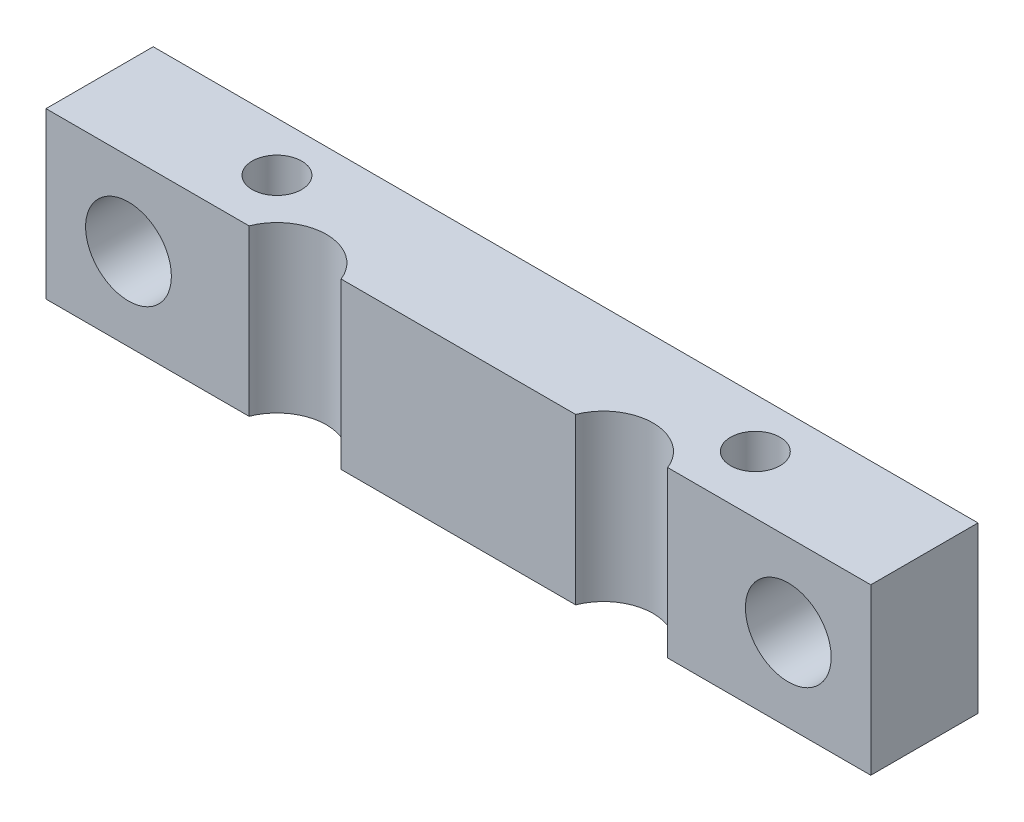
ISO-10303-21;
HEADER;
FILE_DESCRIPTION(('STEP AP214'),'2;1');
FILE_NAME('part.step','',(''),(''),'','','');
FILE_SCHEMA(('AUTOMOTIVE_DESIGN { 1 0 10303 214 1 1 1 1 }'));
ENDSEC;
DATA;
#1=APPLICATION_CONTEXT('core data for automotive mechanical design processes');
#2=APPLICATION_PROTOCOL_DEFINITION('international standard','automotive_design',2000,#1);
#3=PRODUCT_CONTEXT('',#1,'mechanical');
#4=PRODUCT('Part','Part','',(#3));
#5=PRODUCT_RELATED_PRODUCT_CATEGORY('part','',(#4));
#6=PRODUCT_DEFINITION_FORMATION('','',#4);
#7=PRODUCT_DEFINITION_CONTEXT('part definition',#1,'design');
#8=PRODUCT_DEFINITION('design','',#6,#7);
#9=PRODUCT_DEFINITION_SHAPE('','',#8);
#10=(LENGTH_UNIT() NAMED_UNIT(*) SI_UNIT(.MILLI.,.METRE.));
#11=(NAMED_UNIT(*) PLANE_ANGLE_UNIT() SI_UNIT($,.RADIAN.));
#12=(NAMED_UNIT(*) SI_UNIT($,.STERADIAN.) SOLID_ANGLE_UNIT());
#13=UNCERTAINTY_MEASURE_WITH_UNIT(LENGTH_MEASURE(1.E-05),#10,'distance_accuracy_value','');
#14=(GEOMETRIC_REPRESENTATION_CONTEXT(3) GLOBAL_UNCERTAINTY_ASSIGNED_CONTEXT((#13)) GLOBAL_UNIT_ASSIGNED_CONTEXT((#10,
#11,#12)) REPRESENTATION_CONTEXT('',''));
#15=CARTESIAN_POINT('',(0.,0.,0.));
#16=DIRECTION('',(0.,0.,1.));
#17=DIRECTION('',(1.,0.,0.));
#18=AXIS2_PLACEMENT_3D('',#15,#16,#17);
#19=CARTESIAN_POINT('',(15.1005050633883,10.,1.10050506338833));
#20=DIRECTION('',(0.,1.,0.));
#21=DIRECTION('',(0.,0.,1.));
#22=AXIS2_PLACEMENT_3D('',#19,#20,#21);
#23=PLANE('',#22);
#24=CARTESIAN_POINT('',(10.5,10.,-3.5));
#25=DIRECTION('',(0.,1.,0.));
#26=DIRECTION('',(0.,0.,1.));
#27=AXIS2_PLACEMENT_3D('',#24,#25,#26);
#28=CIRCLE('',#27,1.5);
#29=CARTESIAN_POINT('',(10.5,10.,-2.));
#30=VERTEX_POINT('',#29);
#31=EDGE_CURVE('E135',#30,#30,#28,.T.);
#32=ORIENTED_EDGE('',*,*,#31,.F.);
#33=EDGE_LOOP('',(#32));
#34=FACE_BOUND('',#33,.T.);
#35=DIRECTION('',(0.,0.,1.));
#36=VECTOR('',#35,1.);
#37=CARTESIAN_POINT('',(0.,10.,-6.5));
#38=LINE('',#37,#36);
#39=CARTESIAN_POINT('',(0.,10.,-6.5));
#40=VERTEX_POINT('',#39);
#41=CARTESIAN_POINT('',(0.,10.,0.));
#42=VERTEX_POINT('',#41);
#43=EDGE_CURVE('E146',#40,#42,#38,.T.);
#44=ORIENTED_EDGE('',*,*,#43,.T.);
#45=DIRECTION('',(1.,0.,0.));
#46=VECTOR('',#45,1.);
#47=CARTESIAN_POINT('',(0.,10.,0.));
#48=LINE('',#47,#46);
#49=CARTESIAN_POINT('',(12.3096470223091,10.,0.));
#50=VERTEX_POINT('',#49);
#51=EDGE_CURVE('E94',#42,#50,#48,.T.);
#52=ORIENTED_EDGE('',*,*,#51,.T.);
#53=CARTESIAN_POINT('',(15.1005050633883,10.,1.10050506338833));
#54=DIRECTION('',(0.,-1.,0.));
#55=DIRECTION('',(0.,0.,1.));
#56=AXIS2_PLACEMENT_3D('',#53,#54,#55);
#57=CIRCLE('',#56,3.);
#58=CARTESIAN_POINT('',(17.8913631044676,10.,0.));
#59=VERTEX_POINT('',#58);
#60=EDGE_CURVE('E161',#50,#59,#57,.T.);
#61=ORIENTED_EDGE('',*,*,#60,.T.);
#62=DIRECTION('',(1.,0.,0.));
#63=VECTOR('',#62,1.);
#64=CARTESIAN_POINT('',(17.8913631044676,10.,0.));
#65=LINE('',#64,#63);
#66=CARTESIAN_POINT('',(32.1086368955324,10.,0.));
#67=VERTEX_POINT('',#66);
#68=EDGE_CURVE('E174',#59,#67,#65,.T.);
#69=ORIENTED_EDGE('',*,*,#68,.T.);
#70=CARTESIAN_POINT('',(34.8994949366117,10.,1.10050506338833));
#71=DIRECTION('',(0.,-1.,0.));
#72=DIRECTION('',(0.,0.,1.));
#73=AXIS2_PLACEMENT_3D('',#70,#71,#72);
#74=CIRCLE('',#73,3.);
#75=CARTESIAN_POINT('',(37.6903529776909,10.,0.));
#76=VERTEX_POINT('',#75);
#77=EDGE_CURVE('E113',#67,#76,#74,.T.);
#78=ORIENTED_EDGE('',*,*,#77,.T.);
#79=DIRECTION('',(1.,0.,0.));
#80=VECTOR('',#79,1.);
#81=CARTESIAN_POINT('',(37.6903529776909,10.,0.));
#82=LINE('',#81,#80);
#83=CARTESIAN_POINT('',(50.,10.,0.));
#84=VERTEX_POINT('',#83);
#85=EDGE_CURVE('E107',#76,#84,#82,.T.);
#86=ORIENTED_EDGE('',*,*,#85,.T.);
#87=DIRECTION('',(0.,0.,-1.));
#88=VECTOR('',#87,1.);
#89=CARTESIAN_POINT('',(50.,10.,0.));
#90=LINE('',#89,#88);
#91=CARTESIAN_POINT('',(50.,10.,-6.5));
#92=VERTEX_POINT('',#91);
#93=EDGE_CURVE('E111',#84,#92,#90,.T.);
#94=ORIENTED_EDGE('',*,*,#93,.T.);
#95=DIRECTION('',(-1.,0.,0.));
#96=VECTOR('',#95,1.);
#97=CARTESIAN_POINT('',(50.,10.,-6.5));
#98=LINE('',#97,#96);
#99=EDGE_CURVE('E51',#92,#40,#98,.T.);
#100=ORIENTED_EDGE('',*,*,#99,.T.);
#101=EDGE_LOOP('',(#44,#52,#61,#69,#78,#86,#94,#100));
#102=FACE_BOUND('',#101,.T.);
#103=CARTESIAN_POINT('',(39.5,10.,-3.5));
#104=DIRECTION('',(0.,1.,0.));
#105=DIRECTION('',(0.,0.,1.));
#106=AXIS2_PLACEMENT_3D('',#103,#104,#105);
#107=CIRCLE('',#106,1.5);
#108=CARTESIAN_POINT('',(39.5,10.,-2.));
#109=VERTEX_POINT('',#108);
#110=EDGE_CURVE('E183',#109,#109,#107,.T.);
#111=ORIENTED_EDGE('',*,*,#110,.F.);
#112=EDGE_LOOP('',(#111));
#113=FACE_BOUND('',#112,.T.);
#114=ADVANCED_FACE('F34',(#34,#102,#113),#23,.T.);
#115=CARTESIAN_POINT('',(15.1005050633883,0.,1.10050506338833));
#116=DIRECTION('',(0.,1.,0.));
#117=DIRECTION('',(0.,0.,1.));
#118=AXIS2_PLACEMENT_3D('',#115,#116,#117);
#119=PLANE('',#118);
#120=CARTESIAN_POINT('',(10.5,0.,-3.5));
#121=DIRECTION('',(0.,1.,0.));
#122=DIRECTION('',(0.,0.,1.));
#123=AXIS2_PLACEMENT_3D('',#120,#121,#122);
#124=CIRCLE('',#123,1.5);
#125=CARTESIAN_POINT('',(10.5,0.,-2.));
#126=VERTEX_POINT('',#125);
#127=EDGE_CURVE('E180',#126,#126,#124,.T.);
#128=ORIENTED_EDGE('',*,*,#127,.T.);
#129=EDGE_LOOP('',(#128));
#130=FACE_BOUND('',#129,.T.);
#131=DIRECTION('',(0.,0.,1.));
#132=VECTOR('',#131,1.);
#133=CARTESIAN_POINT('',(0.,0.,-6.5));
#134=LINE('',#133,#132);
#135=CARTESIAN_POINT('',(0.,0.,-6.5));
#136=VERTEX_POINT('',#135);
#137=CARTESIAN_POINT('',(0.,0.,0.));
#138=VERTEX_POINT('',#137);
#139=EDGE_CURVE('E131',#136,#138,#134,.T.);
#140=ORIENTED_EDGE('',*,*,#139,.F.);
#141=DIRECTION('',(-1.,0.,0.));
#142=VECTOR('',#141,1.);
#143=CARTESIAN_POINT('',(50.,0.,-6.5));
#144=LINE('',#143,#142);
#145=CARTESIAN_POINT('',(50.,0.,-6.5));
#146=VERTEX_POINT('',#145);
#147=EDGE_CURVE('E86',#146,#136,#144,.T.);
#148=ORIENTED_EDGE('',*,*,#147,.F.);
#149=DIRECTION('',(0.,0.,-1.));
#150=VECTOR('',#149,1.);
#151=CARTESIAN_POINT('',(50.,0.,0.));
#152=LINE('',#151,#150);
#153=CARTESIAN_POINT('',(50.,0.,0.));
#154=VERTEX_POINT('',#153);
#155=EDGE_CURVE('E80',#154,#146,#152,.T.);
#156=ORIENTED_EDGE('',*,*,#155,.F.);
#157=DIRECTION('',(1.,0.,0.));
#158=VECTOR('',#157,1.);
#159=CARTESIAN_POINT('',(37.6903529776909,0.,0.));
#160=LINE('',#159,#158);
#161=CARTESIAN_POINT('',(37.6903529776909,0.,0.));
#162=VERTEX_POINT('',#161);
#163=EDGE_CURVE('E121',#162,#154,#160,.T.);
#164=ORIENTED_EDGE('',*,*,#163,.F.);
#165=CARTESIAN_POINT('',(34.8994949366117,0.,1.10050506338833));
#166=DIRECTION('',(0.,-1.,0.));
#167=DIRECTION('',(0.,0.,1.));
#168=AXIS2_PLACEMENT_3D('',#165,#166,#167);
#169=CIRCLE('',#168,3.);
#170=CARTESIAN_POINT('',(32.1086368955324,0.,0.));
#171=VERTEX_POINT('',#170);
#172=EDGE_CURVE('E141',#171,#162,#169,.T.);
#173=ORIENTED_EDGE('',*,*,#172,.F.);
#174=DIRECTION('',(1.,0.,0.));
#175=VECTOR('',#174,1.);
#176=CARTESIAN_POINT('',(17.8913631044676,0.,0.));
#177=LINE('',#176,#175);
#178=CARTESIAN_POINT('',(17.8913631044676,0.,0.));
#179=VERTEX_POINT('',#178);
#180=EDGE_CURVE('E139',#179,#171,#177,.T.);
#181=ORIENTED_EDGE('',*,*,#180,.F.);
#182=CARTESIAN_POINT('',(15.1005050633883,0.,1.10050506338833));
#183=DIRECTION('',(0.,-1.,0.));
#184=DIRECTION('',(0.,0.,1.));
#185=AXIS2_PLACEMENT_3D('',#182,#183,#184);
#186=CIRCLE('',#185,3.);
#187=CARTESIAN_POINT('',(12.3096470223091,0.,0.));
#188=VERTEX_POINT('',#187);
#189=EDGE_CURVE('E137',#188,#179,#186,.T.);
#190=ORIENTED_EDGE('',*,*,#189,.F.);
#191=DIRECTION('',(1.,0.,0.));
#192=VECTOR('',#191,1.);
#193=CARTESIAN_POINT('',(0.,0.,0.));
#194=LINE('',#193,#192);
#195=EDGE_CURVE('E134',#138,#188,#194,.T.);
#196=ORIENTED_EDGE('',*,*,#195,.F.);
#197=EDGE_LOOP('',(#140,#148,#156,#164,#173,#181,#190,#196));
#198=FACE_BOUND('',#197,.T.);
#199=CARTESIAN_POINT('',(39.5,0.,-3.5));
#200=DIRECTION('',(0.,1.,0.));
#201=DIRECTION('',(0.,0.,1.));
#202=AXIS2_PLACEMENT_3D('',#199,#200,#201);
#203=CIRCLE('',#202,1.5);
#204=CARTESIAN_POINT('',(39.5,0.,-2.));
#205=VERTEX_POINT('',#204);
#206=EDGE_CURVE('E186',#205,#205,#203,.T.);
#207=ORIENTED_EDGE('',*,*,#206,.T.);
#208=EDGE_LOOP('',(#207));
#209=FACE_BOUND('',#208,.T.);
#210=ADVANCED_FACE('F165',(#130,#198,#209),#119,.F.);
#211=CARTESIAN_POINT('',(0.,10.,-6.5));
#212=DIRECTION('',(1.,0.,0.));
#213=DIRECTION('',(0.,0.,-1.));
#214=AXIS2_PLACEMENT_3D('',#211,#212,#213);
#215=PLANE('',#214);
#216=ORIENTED_EDGE('',*,*,#139,.T.);
#217=DIRECTION('',(0.,-1.,0.));
#218=VECTOR('',#217,1.);
#219=CARTESIAN_POINT('',(0.,10.,0.));
#220=LINE('',#219,#218);
#221=EDGE_CURVE('E11',#42,#138,#220,.T.);
#222=ORIENTED_EDGE('',*,*,#221,.F.);
#223=ORIENTED_EDGE('',*,*,#43,.F.);
#224=DIRECTION('',(0.,-1.,0.));
#225=VECTOR('',#224,1.);
#226=CARTESIAN_POINT('',(0.,10.,-6.5));
#227=LINE('',#226,#225);
#228=EDGE_CURVE('E127',#40,#136,#227,.T.);
#229=ORIENTED_EDGE('',*,*,#228,.T.);
#230=EDGE_LOOP('',(#216,#222,#223,#229));
#231=FACE_BOUND('',#230,.T.);
#232=ADVANCED_FACE('F36',(#231),#215,.F.);
#233=CARTESIAN_POINT('',(0.,10.,0.));
#234=DIRECTION('',(0.,0.,-1.));
#235=DIRECTION('',(-1.,0.,0.));
#236=AXIS2_PLACEMENT_3D('',#233,#234,#235);
#237=PLANE('',#236);
#238=CARTESIAN_POINT('',(5.,5.,0.));
#239=DIRECTION('',(0.,0.,1.));
#240=DIRECTION('',(1.,0.,0.));
#241=AXIS2_PLACEMENT_3D('',#238,#239,#240);
#242=CIRCLE('',#241,2.6);
#243=CARTESIAN_POINT('',(7.6,5.,0.));
#244=VERTEX_POINT('',#243);
#245=EDGE_CURVE('E194',#244,#244,#242,.T.);
#246=ORIENTED_EDGE('',*,*,#245,.F.);
#247=EDGE_LOOP('',(#246));
#248=FACE_BOUND('',#247,.T.);
#249=ORIENTED_EDGE('',*,*,#195,.T.);
#250=DIRECTION('',(0.,-1.,0.));
#251=VECTOR('',#250,1.);
#252=CARTESIAN_POINT('',(12.3096470223091,10.,0.));
#253=LINE('',#252,#251);
#254=EDGE_CURVE('E43',#50,#188,#253,.T.);
#255=ORIENTED_EDGE('',*,*,#254,.F.);
#256=ORIENTED_EDGE('',*,*,#51,.F.);
#257=ORIENTED_EDGE('',*,*,#221,.T.);
#258=EDGE_LOOP('',(#249,#255,#256,#257));
#259=FACE_BOUND('',#258,.T.);
#260=ADVANCED_FACE('F253',(#248,#259),#237,.F.);
#261=CARTESIAN_POINT('',(15.1005050633883,10.,1.10050506338833));
#262=DIRECTION('',(0.,-1.,0.));
#263=DIRECTION('',(0.,0.,-1.));
#264=AXIS2_PLACEMENT_3D('',#261,#262,#263);
#265=CYLINDRICAL_SURFACE('',#264,3.);
#266=ORIENTED_EDGE('',*,*,#189,.T.);
#267=DIRECTION('',(0.,-1.,0.));
#268=VECTOR('',#267,1.);
#269=CARTESIAN_POINT('',(17.8913631044676,10.,0.));
#270=LINE('',#269,#268);
#271=EDGE_CURVE('E153',#59,#179,#270,.T.);
#272=ORIENTED_EDGE('',*,*,#271,.F.);
#273=ORIENTED_EDGE('',*,*,#60,.F.);
#274=ORIENTED_EDGE('',*,*,#254,.T.);
#275=EDGE_LOOP('',(#266,#272,#273,#274));
#276=FACE_BOUND('',#275,.T.);
#277=ADVANCED_FACE('F159',(#276),#265,.F.);
#278=CARTESIAN_POINT('',(17.8913631044676,10.,0.));
#279=DIRECTION('',(0.,0.,-1.));
#280=DIRECTION('',(-1.,0.,0.));
#281=AXIS2_PLACEMENT_3D('',#278,#279,#280);
#282=PLANE('',#281);
#283=ORIENTED_EDGE('',*,*,#180,.T.);
#284=DIRECTION('',(0.,-1.,0.));
#285=VECTOR('',#284,1.);
#286=CARTESIAN_POINT('',(32.1086368955324,10.,0.));
#287=LINE('',#286,#285);
#288=EDGE_CURVE('E150',#67,#171,#287,.T.);
#289=ORIENTED_EDGE('',*,*,#288,.F.);
#290=ORIENTED_EDGE('',*,*,#68,.F.);
#291=ORIENTED_EDGE('',*,*,#271,.T.);
#292=EDGE_LOOP('',(#283,#289,#290,#291));
#293=FACE_BOUND('',#292,.T.);
#294=ADVANCED_FACE('F170',(#293),#282,.F.);
#295=CARTESIAN_POINT('',(34.8994949366117,10.,1.10050506338833));
#296=DIRECTION('',(0.,-1.,0.));
#297=DIRECTION('',(0.,0.,-1.));
#298=AXIS2_PLACEMENT_3D('',#295,#296,#297);
#299=CYLINDRICAL_SURFACE('',#298,3.);
#300=ORIENTED_EDGE('',*,*,#172,.T.);
#301=DIRECTION('',(0.,-1.,0.));
#302=VECTOR('',#301,1.);
#303=CARTESIAN_POINT('',(37.6903529776909,10.,0.));
#304=LINE('',#303,#302);
#305=EDGE_CURVE('E122',#76,#162,#304,.T.);
#306=ORIENTED_EDGE('',*,*,#305,.F.);
#307=ORIENTED_EDGE('',*,*,#77,.F.);
#308=ORIENTED_EDGE('',*,*,#288,.T.);
#309=EDGE_LOOP('',(#300,#306,#307,#308));
#310=FACE_BOUND('',#309,.T.);
#311=ADVANCED_FACE('F173',(#310),#299,.F.);
#312=CARTESIAN_POINT('',(37.6903529776909,10.,0.));
#313=DIRECTION('',(0.,0.,-1.));
#314=DIRECTION('',(-1.,0.,0.));
#315=AXIS2_PLACEMENT_3D('',#312,#313,#314);
#316=PLANE('',#315);
#317=CARTESIAN_POINT('',(45.,5.00000000000001,0.));
#318=DIRECTION('',(0.,0.,1.));
#319=DIRECTION('',(1.,0.,0.));
#320=AXIS2_PLACEMENT_3D('',#317,#318,#319);
#321=CIRCLE('',#320,2.6);
#322=CARTESIAN_POINT('',(47.6,5.00000000000001,0.));
#323=VERTEX_POINT('',#322);
#324=EDGE_CURVE('E200',#323,#323,#321,.T.);
#325=ORIENTED_EDGE('',*,*,#324,.F.);
#326=EDGE_LOOP('',(#325));
#327=FACE_BOUND('',#326,.T.);
#328=ORIENTED_EDGE('',*,*,#163,.T.);
#329=DIRECTION('',(0.,-1.,0.));
#330=VECTOR('',#329,1.);
#331=CARTESIAN_POINT('',(50.,10.,0.));
#332=LINE('',#331,#330);
#333=EDGE_CURVE('E118',#84,#154,#332,.T.);
#334=ORIENTED_EDGE('',*,*,#333,.F.);
#335=ORIENTED_EDGE('',*,*,#85,.F.);
#336=ORIENTED_EDGE('',*,*,#305,.T.);
#337=EDGE_LOOP('',(#328,#334,#335,#336));
#338=FACE_BOUND('',#337,.T.);
#339=ADVANCED_FACE('F119',(#327,#338),#316,.F.);
#340=CARTESIAN_POINT('',(50.,10.,0.));
#341=DIRECTION('',(-1.,0.,0.));
#342=DIRECTION('',(0.,0.,1.));
#343=AXIS2_PLACEMENT_3D('',#340,#341,#342);
#344=PLANE('',#343);
#345=ORIENTED_EDGE('',*,*,#155,.T.);
#346=DIRECTION('',(0.,-1.,0.));
#347=VECTOR('',#346,1.);
#348=CARTESIAN_POINT('',(50.,10.,-6.5));
#349=LINE('',#348,#347);
#350=EDGE_CURVE('E123',#92,#146,#349,.T.);
#351=ORIENTED_EDGE('',*,*,#350,.F.);
#352=ORIENTED_EDGE('',*,*,#93,.F.);
#353=ORIENTED_EDGE('',*,*,#333,.T.);
#354=EDGE_LOOP('',(#345,#351,#352,#353));
#355=FACE_BOUND('',#354,.T.);
#356=ADVANCED_FACE('F125',(#355),#344,.F.);
#357=CARTESIAN_POINT('',(50.,10.,-6.5));
#358=DIRECTION('',(0.,0.,1.));
#359=DIRECTION('',(1.,0.,0.));
#360=AXIS2_PLACEMENT_3D('',#357,#358,#359);
#361=PLANE('',#360);
#362=CARTESIAN_POINT('',(45.,5.00000000000001,-6.5));
#363=DIRECTION('',(0.,0.,1.));
#364=DIRECTION('',(1.,0.,0.));
#365=AXIS2_PLACEMENT_3D('',#362,#363,#364);
#366=CIRCLE('',#365,2.6);
#367=CARTESIAN_POINT('',(47.6,5.00000000000001,-6.5));
#368=VERTEX_POINT('',#367);
#369=EDGE_CURVE('E197',#368,#368,#366,.F.);
#370=ORIENTED_EDGE('',*,*,#369,.F.);
#371=EDGE_LOOP('',(#370));
#372=FACE_BOUND('',#371,.T.);
#373=CARTESIAN_POINT('',(5.,5.,-6.5));
#374=DIRECTION('',(0.,0.,1.));
#375=DIRECTION('',(1.,0.,0.));
#376=AXIS2_PLACEMENT_3D('',#373,#374,#375);
#377=CIRCLE('',#376,2.6);
#378=CARTESIAN_POINT('',(7.6,5.,-6.5));
#379=VERTEX_POINT('',#378);
#380=EDGE_CURVE('E189',#379,#379,#377,.F.);
#381=ORIENTED_EDGE('',*,*,#380,.F.);
#382=EDGE_LOOP('',(#381));
#383=FACE_BOUND('',#382,.T.);
#384=ORIENTED_EDGE('',*,*,#147,.T.);
#385=ORIENTED_EDGE('',*,*,#228,.F.);
#386=ORIENTED_EDGE('',*,*,#99,.F.);
#387=ORIENTED_EDGE('',*,*,#350,.T.);
#388=EDGE_LOOP('',(#384,#385,#386,#387));
#389=FACE_BOUND('',#388,.T.);
#390=ADVANCED_FACE('F214',(#372,#383,#389),#361,.F.);
#391=CARTESIAN_POINT('',(10.5,10.,-3.5));
#392=DIRECTION('',(0.,-1.,0.));
#393=DIRECTION('',(0.,0.,-1.));
#394=AXIS2_PLACEMENT_3D('',#391,#392,#393);
#395=CYLINDRICAL_SURFACE('',#394,1.5);
#396=ORIENTED_EDGE('',*,*,#31,.T.);
#397=EDGE_LOOP('',(#396));
#398=FACE_BOUND('',#397,.T.);
#399=ORIENTED_EDGE('',*,*,#127,.F.);
#400=EDGE_LOOP('',(#399));
#401=FACE_BOUND('',#400,.T.);
#402=ADVANCED_FACE('F228',(#398,#401),#395,.F.);
#403=CARTESIAN_POINT('',(39.5,10.,-3.5));
#404=DIRECTION('',(0.,-1.,0.));
#405=DIRECTION('',(0.,0.,-1.));
#406=AXIS2_PLACEMENT_3D('',#403,#404,#405);
#407=CYLINDRICAL_SURFACE('',#406,1.5);
#408=ORIENTED_EDGE('',*,*,#110,.T.);
#409=EDGE_LOOP('',(#408));
#410=FACE_BOUND('',#409,.T.);
#411=ORIENTED_EDGE('',*,*,#206,.F.);
#412=EDGE_LOOP('',(#411));
#413=FACE_BOUND('',#412,.T.);
#414=ADVANCED_FACE('F236',(#410,#413),#407,.F.);
#415=CARTESIAN_POINT('',(5.,5.,-6.501));
#416=DIRECTION('',(0.,0.,1.));
#417=DIRECTION('',(1.,0.,0.));
#418=AXIS2_PLACEMENT_3D('',#415,#416,#417);
#419=CYLINDRICAL_SURFACE('',#418,2.6);
#420=ORIENTED_EDGE('',*,*,#245,.T.);
#421=EDGE_LOOP('',(#420));
#422=FACE_BOUND('',#421,.T.);
#423=ORIENTED_EDGE('',*,*,#380,.T.);
#424=EDGE_LOOP('',(#423));
#425=FACE_BOUND('',#424,.T.);
#426=ADVANCED_FACE('F242',(#422,#425),#419,.F.);
#427=CARTESIAN_POINT('',(45.,5.00000000000001,-6.501));
#428=DIRECTION('',(0.,0.,1.));
#429=DIRECTION('',(1.,0.,0.));
#430=AXIS2_PLACEMENT_3D('',#427,#428,#429);
#431=CYLINDRICAL_SURFACE('',#430,2.6);
#432=ORIENTED_EDGE('',*,*,#324,.T.);
#433=EDGE_LOOP('',(#432));
#434=FACE_BOUND('',#433,.T.);
#435=ORIENTED_EDGE('',*,*,#369,.T.);
#436=EDGE_LOOP('',(#435));
#437=FACE_BOUND('',#436,.T.);
#438=ADVANCED_FACE('F204',(#434,#437),#431,.F.);
#439=CLOSED_SHELL('',(#114,#210,#232,#260,#277,#294,#311,#339,#356,#390,#402,#414,#426,#438));
#440=MANIFOLD_SOLID_BREP('B2',#439);
#441=ADVANCED_BREP_SHAPE_REPRESENTATION('',(#18,#440),#14);
#442=SHAPE_DEFINITION_REPRESENTATION(#9,#441);
ENDSEC;
END-ISO-10303-21;
